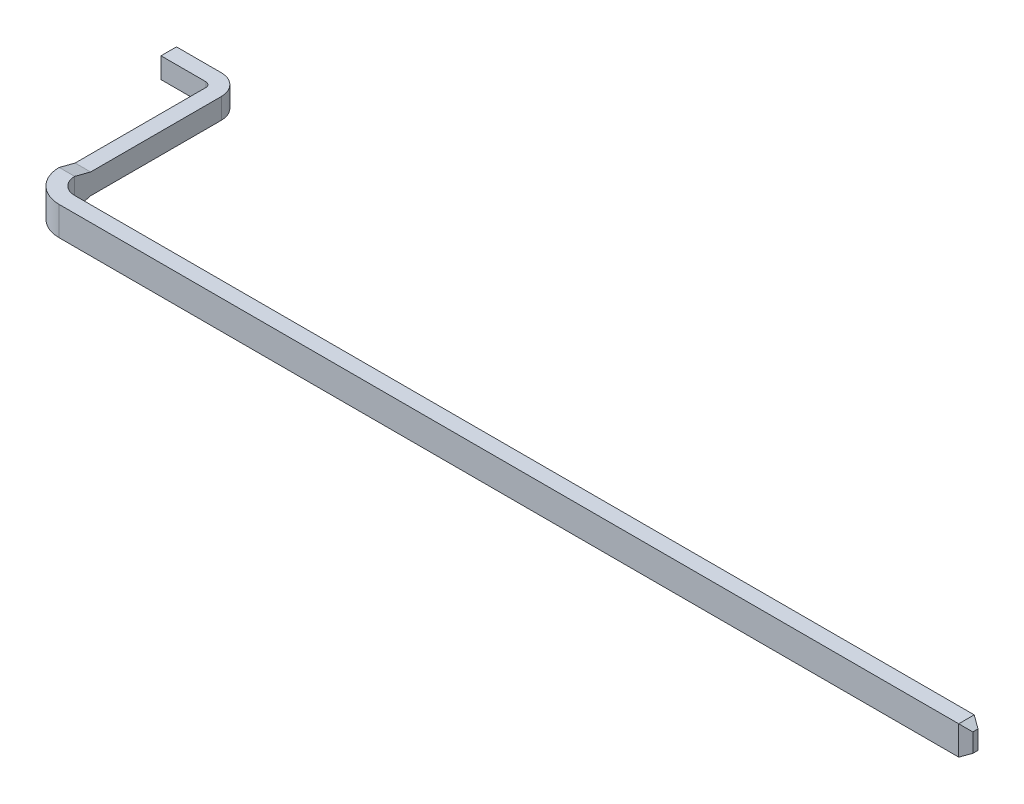
ISO-10303-21;
HEADER;
FILE_DESCRIPTION(('STEP AP214'),'2;1');
FILE_NAME('part.step','',(''),(''),'','','');
FILE_SCHEMA(('AUTOMOTIVE_DESIGN { 1 0 10303 214 1 1 1 1 }'));
ENDSEC;
DATA;
#1=APPLICATION_CONTEXT('core data for automotive mechanical design processes');
#2=APPLICATION_PROTOCOL_DEFINITION('international standard','automotive_design',2000,#1);
#3=PRODUCT_CONTEXT('',#1,'mechanical');
#4=PRODUCT('Part','Part','',(#3));
#5=PRODUCT_RELATED_PRODUCT_CATEGORY('part','',(#4));
#6=PRODUCT_DEFINITION_FORMATION('','',#4);
#7=PRODUCT_DEFINITION_CONTEXT('part definition',#1,'design');
#8=PRODUCT_DEFINITION('design','',#6,#7);
#9=PRODUCT_DEFINITION_SHAPE('','',#8);
#10=(LENGTH_UNIT() NAMED_UNIT(*) SI_UNIT(.MILLI.,.METRE.));
#11=(NAMED_UNIT(*) PLANE_ANGLE_UNIT() SI_UNIT($,.RADIAN.));
#12=(NAMED_UNIT(*) SI_UNIT($,.STERADIAN.) SOLID_ANGLE_UNIT());
#13=UNCERTAINTY_MEASURE_WITH_UNIT(LENGTH_MEASURE(1.E-05),#10,'distance_accuracy_value','');
#14=(GEOMETRIC_REPRESENTATION_CONTEXT(3) GLOBAL_UNCERTAINTY_ASSIGNED_CONTEXT((#13)) GLOBAL_UNIT_ASSIGNED_CONTEXT((#10,
#11,#12)) REPRESENTATION_CONTEXT('',''));
#15=CARTESIAN_POINT('',(0.,0.,0.));
#16=DIRECTION('',(0.,0.,1.));
#17=DIRECTION('',(1.,0.,0.));
#18=AXIS2_PLACEMENT_3D('',#15,#16,#17);
#19=CARTESIAN_POINT('',(-0.633705765484,0.14,0.39));
#20=DIRECTION('',(0.,0.,-1.));
#21=DIRECTION('',(-1.,0.,0.));
#22=AXIS2_PLACEMENT_3D('',#19,#20,#21);
#23=PLANE('',#22);
#24=DIRECTION('',(1.,0.,0.));
#25=VECTOR('',#24,1.);
#26=CARTESIAN_POINT('',(0.16,-0.1,0.39));
#27=LINE('',#26,#25);
#28=CARTESIAN_POINT('',(-0.2,-0.1,0.39));
#29=VERTEX_POINT('',#28);
#30=CARTESIAN_POINT('',(-0.633705765484,-0.1,0.39));
#31=VERTEX_POINT('',#30);
#32=EDGE_CURVE('E122',#29,#31,#27,.F.);
#33=ORIENTED_EDGE('',*,*,#32,.T.);
#34=DIRECTION('',(0.,1.,0.));
#35=VECTOR('',#34,1.);
#36=CARTESIAN_POINT('',(-0.633705765484,0.14,0.39));
#37=LINE('',#36,#35);
#38=CARTESIAN_POINT('',(-0.633705765484,0.1,0.39));
#39=VERTEX_POINT('',#38);
#40=EDGE_CURVE('E125',#31,#39,#37,.T.);
#41=ORIENTED_EDGE('',*,*,#40,.T.);
#42=DIRECTION('',(1.,0.,0.));
#43=VECTOR('',#42,1.);
#44=CARTESIAN_POINT('',(0.16,0.1,0.39));
#45=LINE('',#44,#43);
#46=CARTESIAN_POINT('',(-0.2,0.1,0.39));
#47=VERTEX_POINT('',#46);
#48=EDGE_CURVE('E162',#47,#39,#45,.F.);
#49=ORIENTED_EDGE('',*,*,#48,.F.);
#50=DIRECTION('',(0.,1.,0.));
#51=VECTOR('',#50,1.);
#52=CARTESIAN_POINT('',(-0.2,-0.1,0.39));
#53=LINE('',#52,#51);
#54=EDGE_CURVE('E127',#29,#47,#53,.T.);
#55=ORIENTED_EDGE('',*,*,#54,.F.);
#56=EDGE_LOOP('',(#33,#41,#49,#55));
#57=FACE_BOUND('',#56,.T.);
#58=ADVANCED_FACE('F17',(#57),#23,.T.);
#59=CARTESIAN_POINT('',(-0.633705765484,0.14,0.39));
#60=DIRECTION('',(1.,0.,0.));
#61=DIRECTION('',(0.,0.,-1.));
#62=AXIS2_PLACEMENT_3D('',#59,#60,#61);
#63=PLANE('',#62);
#64=DIRECTION('',(0.,0.,1.));
#65=VECTOR('',#64,1.);
#66=CARTESIAN_POINT('',(-0.633705765484,0.1,1.855));
#67=LINE('',#66,#65);
#68=CARTESIAN_POINT('',(-0.633705765484,0.1,0.54));
#69=VERTEX_POINT('',#68);
#70=EDGE_CURVE('E139',#39,#69,#67,.T.);
#71=ORIENTED_EDGE('',*,*,#70,.F.);
#72=ORIENTED_EDGE('',*,*,#40,.F.);
#73=DIRECTION('',(0.,0.,1.));
#74=VECTOR('',#73,1.);
#75=CARTESIAN_POINT('',(-0.633705765484,-0.1,1.855));
#76=LINE('',#75,#74);
#77=CARTESIAN_POINT('',(-0.633705765484,-0.1,0.54));
#78=VERTEX_POINT('',#77);
#79=EDGE_CURVE('E132',#31,#78,#76,.T.);
#80=ORIENTED_EDGE('',*,*,#79,.T.);
#81=DIRECTION('',(0.,1.,0.));
#82=VECTOR('',#81,1.);
#83=CARTESIAN_POINT('',(-0.633705765484,0.14,0.54));
#84=LINE('',#83,#82);
#85=EDGE_CURVE('E141',#78,#69,#84,.T.);
#86=ORIENTED_EDGE('',*,*,#85,.T.);
#87=EDGE_LOOP('',(#71,#72,#80,#86));
#88=FACE_BOUND('',#87,.T.);
#89=ADVANCED_FACE('F136',(#88),#63,.F.);
#90=CARTESIAN_POINT('',(-0.633705765484,0.14,0.54));
#91=DIRECTION('',(0.,0.,-1.));
#92=DIRECTION('',(-1.,0.,0.));
#93=AXIS2_PLACEMENT_3D('',#90,#91,#92);
#94=PLANE('',#93);
#95=DIRECTION('',(1.,0.,0.));
#96=VECTOR('',#95,1.);
#97=CARTESIAN_POINT('',(0.16,0.1,0.54));
#98=LINE('',#97,#96);
#99=CARTESIAN_POINT('',(-0.2,0.1,0.54));
#100=VERTEX_POINT('',#99);
#101=EDGE_CURVE('E161',#69,#100,#98,.T.);
#102=ORIENTED_EDGE('',*,*,#101,.F.);
#103=ORIENTED_EDGE('',*,*,#85,.F.);
#104=DIRECTION('',(1.,0.,0.));
#105=VECTOR('',#104,1.);
#106=CARTESIAN_POINT('',(0.16,-0.1,0.54));
#107=LINE('',#106,#105);
#108=CARTESIAN_POINT('',(-0.2,-0.1,0.54));
#109=VERTEX_POINT('',#108);
#110=EDGE_CURVE('E146',#78,#109,#107,.T.);
#111=ORIENTED_EDGE('',*,*,#110,.T.);
#112=DIRECTION('',(0.,1.,0.));
#113=VECTOR('',#112,1.);
#114=CARTESIAN_POINT('',(-0.2,-0.1,0.54));
#115=LINE('',#114,#113);
#116=EDGE_CURVE('E207',#109,#100,#115,.T.);
#117=ORIENTED_EDGE('',*,*,#116,.T.);
#118=EDGE_LOOP('',(#102,#103,#111,#117));
#119=FACE_BOUND('',#118,.T.);
#120=ADVANCED_FACE('F209',(#119),#94,.F.);
#121=CARTESIAN_POINT('',(-0.2,-0.1,0.59));
#122=DIRECTION('',(0.,1.,0.));
#123=DIRECTION('',(0.,0.,1.));
#124=AXIS2_PLACEMENT_3D('',#121,#122,#123);
#125=CYLINDRICAL_SURFACE('',#124,0.05);
#126=DIRECTION('',(0.,1.,0.));
#127=VECTOR('',#126,1.);
#128=CARTESIAN_POINT('',(-0.15,0.14,0.59));
#129=LINE('',#128,#127);
#130=CARTESIAN_POINT('',(-0.15,-0.1,0.59));
#131=VERTEX_POINT('',#130);
#132=CARTESIAN_POINT('',(-0.15,0.1,0.59));
#133=VERTEX_POINT('',#132);
#134=EDGE_CURVE('E159',#131,#133,#129,.T.);
#135=ORIENTED_EDGE('',*,*,#134,.T.);
#136=CARTESIAN_POINT('',(-0.2,0.1,0.59));
#137=DIRECTION('',(0.,1.,0.));
#138=DIRECTION('',(0.,0.,1.));
#139=AXIS2_PLACEMENT_3D('',#136,#137,#138);
#140=CIRCLE('',#139,0.05);
#141=EDGE_CURVE('E184',#100,#133,#140,.F.);
#142=ORIENTED_EDGE('',*,*,#141,.F.);
#143=ORIENTED_EDGE('',*,*,#116,.F.);
#144=CARTESIAN_POINT('',(-0.2,-0.1,0.59));
#145=DIRECTION('',(0.,1.,0.));
#146=DIRECTION('',(0.,0.,1.));
#147=AXIS2_PLACEMENT_3D('',#144,#145,#146);
#148=CIRCLE('',#147,0.05);
#149=EDGE_CURVE('E148',#109,#131,#148,.F.);
#150=ORIENTED_EDGE('',*,*,#149,.T.);
#151=EDGE_LOOP('',(#135,#142,#143,#150));
#152=FACE_BOUND('',#151,.T.);
#153=ADVANCED_FACE('F544',(#152),#125,.F.);
#154=CARTESIAN_POINT('',(-0.15,0.14,0.));
#155=DIRECTION('',(1.,0.,0.));
#156=DIRECTION('',(0.,0.,-1.));
#157=AXIS2_PLACEMENT_3D('',#154,#155,#156);
#158=PLANE('',#157);
#159=ORIENTED_EDGE('',*,*,#134,.F.);
#160=DIRECTION('',(0.,0.,1.));
#161=VECTOR('',#160,1.);
#162=CARTESIAN_POINT('',(-0.15,-0.1,1.855));
#163=LINE('',#162,#161);
#164=CARTESIAN_POINT('',(-0.15,-0.0999999999999678,1.85500000000001));
#165=VERTEX_POINT('',#164);
#166=EDGE_CURVE('E182',#131,#165,#163,.T.);
#167=ORIENTED_EDGE('',*,*,#166,.T.);
#168=DIRECTION('',(0.,-0.249878019022072,0.96827732370928));
#169=VECTOR('',#168,1.);
#170=CARTESIAN_POINT('',(-0.15,-0.14,2.01));
#171=LINE('',#170,#169);
#172=CARTESIAN_POINT('',(-0.15,-0.14,2.01));
#173=VERTEX_POINT('',#172);
#174=EDGE_CURVE('E240',#165,#173,#171,.T.);
#175=ORIENTED_EDGE('',*,*,#174,.T.);
#176=DIRECTION('',(0.,-1.,0.));
#177=VECTOR('',#176,1.);
#178=CARTESIAN_POINT('',(-0.15,0.14,2.01));
#179=LINE('',#178,#177);
#180=CARTESIAN_POINT('',(-0.15,0.14,2.01));
#181=VERTEX_POINT('',#180);
#182=EDGE_CURVE('E269',#181,#173,#179,.T.);
#183=ORIENTED_EDGE('',*,*,#182,.F.);
#184=DIRECTION('',(0.,0.249878019022072,0.96827732370928));
#185=VECTOR('',#184,1.);
#186=CARTESIAN_POINT('',(-0.15,0.14,2.01));
#187=LINE('',#186,#185);
#188=CARTESIAN_POINT('',(-0.15,0.0999999999999678,1.85500000000001));
#189=VERTEX_POINT('',#188);
#190=EDGE_CURVE('E203',#189,#181,#187,.T.);
#191=ORIENTED_EDGE('',*,*,#190,.F.);
#192=DIRECTION('',(0.,0.,1.));
#193=VECTOR('',#192,1.);
#194=CARTESIAN_POINT('',(-0.15,0.1,1.855));
#195=LINE('',#194,#193);
#196=EDGE_CURVE('E183',#133,#189,#195,.T.);
#197=ORIENTED_EDGE('',*,*,#196,.F.);
#198=EDGE_LOOP('',(#159,#167,#175,#183,#191,#197));
#199=FACE_BOUND('',#198,.T.);
#200=ADVANCED_FACE('F306',(#199),#158,.F.);
#201=CARTESIAN_POINT('',(8.96,0.14,2.27));
#202=DIRECTION('',(0.50000000000019,0.,0.866025403784329));
#203=DIRECTION('',(0.866025403784329,0.,-0.50000000000019));
#204=AXIS2_PLACEMENT_3D('',#201,#202,#203);
#205=PLANE('',#204);
#206=DIRECTION('',(-0.774596669240792,0.447213595499784,0.447213595501328));
#207=VECTOR('',#206,1.);
#208=CARTESIAN_POINT('',(8.9600000000001,0.0900000000001725,2.27));
#209=LINE('',#208,#207);
#210=CARTESIAN_POINT('',(8.96000000000007,0.090000000000115,2.27));
#211=VERTEX_POINT('',#210);
#212=CARTESIAN_POINT('',(8.873397459622,0.14,2.32));
#213=VERTEX_POINT('',#212);
#214=EDGE_CURVE('E241',#211,#213,#209,.T.);
#215=ORIENTED_EDGE('',*,*,#214,.T.);
#216=DIRECTION('',(0.,1.,0.));
#217=VECTOR('',#216,1.);
#218=CARTESIAN_POINT('',(8.873397459622,0.14,2.32));
#219=LINE('',#218,#217);
#220=CARTESIAN_POINT('',(8.87339745962197,-0.139999999999957,2.32));
#221=VERTEX_POINT('',#220);
#222=EDGE_CURVE('E260',#213,#221,#219,.F.);
#223=ORIENTED_EDGE('',*,*,#222,.T.);
#224=DIRECTION('',(-0.774596669240792,-0.447213595499785,0.447213595501328));
#225=VECTOR('',#224,1.);
#226=CARTESIAN_POINT('',(8.96,-0.09,2.27));
#227=LINE('',#226,#225);
#228=CARTESIAN_POINT('',(8.96,-0.09,2.27));
#229=VERTEX_POINT('',#228);
#230=EDGE_CURVE('E252',#229,#221,#227,.T.);
#231=ORIENTED_EDGE('',*,*,#230,.F.);
#232=DIRECTION('',(0.,1.,0.));
#233=VECTOR('',#232,1.);
#234=CARTESIAN_POINT('',(8.96,0.14,2.27));
#235=LINE('',#234,#233);
#236=EDGE_CURVE('E199',#211,#229,#235,.F.);
#237=ORIENTED_EDGE('',*,*,#236,.F.);
#238=EDGE_LOOP('',(#215,#223,#231,#237));
#239=FACE_BOUND('',#238,.T.);
#240=ADVANCED_FACE('F389',(#239),#205,.T.);
#241=CARTESIAN_POINT('',(-0.2,-0.1,0.59));
#242=DIRECTION('',(0.,1.,0.));
#243=DIRECTION('',(0.,0.,1.));
#244=AXIS2_PLACEMENT_3D('',#241,#242,#243);
#245=CYLINDRICAL_SURFACE('',#244,0.2);
#246=CARTESIAN_POINT('',(-0.2,0.1,0.59));
#247=DIRECTION('',(0.,1.,0.));
#248=DIRECTION('',(0.,0.,1.));
#249=AXIS2_PLACEMENT_3D('',#246,#247,#248);
#250=CIRCLE('',#249,0.2);
#251=CARTESIAN_POINT('',(0.,0.1,0.59));
#252=VERTEX_POINT('',#251);
#253=EDGE_CURVE('E20',#252,#47,#250,.T.);
#254=ORIENTED_EDGE('',*,*,#253,.F.);
#255=DIRECTION('',(0.,1.,0.));
#256=VECTOR('',#255,1.);
#257=CARTESIAN_POINT('',(0.,0.14,0.59));
#258=LINE('',#257,#256);
#259=CARTESIAN_POINT('',(0.,-0.1,0.59));
#260=VERTEX_POINT('',#259);
#261=EDGE_CURVE('E214',#260,#252,#258,.T.);
#262=ORIENTED_EDGE('',*,*,#261,.F.);
#263=CARTESIAN_POINT('',(-0.2,-0.1,0.59));
#264=DIRECTION('',(0.,1.,0.));
#265=DIRECTION('',(0.,0.,1.));
#266=AXIS2_PLACEMENT_3D('',#263,#264,#265);
#267=CIRCLE('',#266,0.2);
#268=EDGE_CURVE('E133',#260,#29,#267,.T.);
#269=ORIENTED_EDGE('',*,*,#268,.T.);
#270=ORIENTED_EDGE('',*,*,#54,.T.);
#271=EDGE_LOOP('',(#254,#262,#269,#270));
#272=FACE_BOUND('',#271,.T.);
#273=ADVANCED_FACE('F212',(#272),#245,.T.);
#274=CARTESIAN_POINT('',(0.16,0.1,1.855));
#275=DIRECTION('',(0.,1.,0.));
#276=DIRECTION('',(0.,0.,1.));
#277=AXIS2_PLACEMENT_3D('',#274,#275,#276);
#278=PLANE('',#277);
#279=ORIENTED_EDGE('',*,*,#196,.T.);
#280=DIRECTION('',(1.,0.,0.));
#281=VECTOR('',#280,1.);
#282=CARTESIAN_POINT('',(0.16,0.0999999999999517,1.85500000000001));
#283=LINE('',#282,#281);
#284=CARTESIAN_POINT('',(0.,0.0999999999999834,1.855));
#285=VERTEX_POINT('',#284);
#286=EDGE_CURVE('E101',#285,#189,#283,.F.);
#287=ORIENTED_EDGE('',*,*,#286,.F.);
#288=DIRECTION('',(0.,0.,-1.));
#289=VECTOR('',#288,1.);
#290=CARTESIAN_POINT('',(0.,0.1,0.));
#291=LINE('',#290,#289);
#292=EDGE_CURVE('E247',#252,#285,#291,.F.);
#293=ORIENTED_EDGE('',*,*,#292,.F.);
#294=ORIENTED_EDGE('',*,*,#253,.T.);
#295=ORIENTED_EDGE('',*,*,#48,.T.);
#296=ORIENTED_EDGE('',*,*,#70,.T.);
#297=ORIENTED_EDGE('',*,*,#101,.T.);
#298=ORIENTED_EDGE('',*,*,#141,.T.);
#299=EDGE_LOOP('',(#279,#287,#293,#294,#295,#296,#297,#298));
#300=FACE_BOUND('',#299,.T.);
#301=ADVANCED_FACE('F211',(#300),#278,.T.);
#302=CARTESIAN_POINT('',(0.16,-0.1,1.855));
#303=DIRECTION('',(0.,1.,0.));
#304=DIRECTION('',(0.,0.,1.));
#305=AXIS2_PLACEMENT_3D('',#302,#303,#304);
#306=PLANE('',#305);
#307=ORIENTED_EDGE('',*,*,#149,.F.);
#308=ORIENTED_EDGE('',*,*,#110,.F.);
#309=ORIENTED_EDGE('',*,*,#79,.F.);
#310=ORIENTED_EDGE('',*,*,#32,.F.);
#311=ORIENTED_EDGE('',*,*,#268,.F.);
#312=DIRECTION('',(0.,0.,-1.));
#313=VECTOR('',#312,1.);
#314=CARTESIAN_POINT('',(0.,-0.1,0.));
#315=LINE('',#314,#313);
#316=CARTESIAN_POINT('',(0.,-0.099999999999984,1.855));
#317=VERTEX_POINT('',#316);
#318=EDGE_CURVE('E218',#317,#260,#315,.T.);
#319=ORIENTED_EDGE('',*,*,#318,.F.);
#320=DIRECTION('',(1.,0.,0.));
#321=VECTOR('',#320,1.);
#322=CARTESIAN_POINT('',(0.16,-0.0999999999999517,1.85500000000001));
#323=LINE('',#322,#321);
#324=EDGE_CURVE('E238',#317,#165,#323,.F.);
#325=ORIENTED_EDGE('',*,*,#324,.T.);
#326=ORIENTED_EDGE('',*,*,#166,.F.);
#327=EDGE_LOOP('',(#307,#308,#309,#310,#311,#319,#325,#326));
#328=FACE_BOUND('',#327,.T.);
#329=ADVANCED_FACE('F145',(#328),#306,.F.);
#330=CARTESIAN_POINT('',(0.16,0.14,2.01));
#331=DIRECTION('',(0.,0.96827732370928,-0.249878019022072));
#332=DIRECTION('',(0.,0.249878019022072,0.96827732370928));
#333=AXIS2_PLACEMENT_3D('',#330,#331,#332);
#334=PLANE('',#333);
#335=DIRECTION('',(1.,0.,0.));
#336=VECTOR('',#335,1.);
#337=CARTESIAN_POINT('',(0.16,0.14,2.01));
#338=LINE('',#337,#336);
#339=CARTESIAN_POINT('',(0.,0.14,2.01));
#340=VERTEX_POINT('',#339);
#341=EDGE_CURVE('E180',#340,#181,#338,.F.);
#342=ORIENTED_EDGE('',*,*,#341,.F.);
#343=DIRECTION('',(0.,0.24987801902177,0.968277323709357));
#344=VECTOR('',#343,1.);
#345=CARTESIAN_POINT('',(0.,0.1,1.855));
#346=LINE('',#345,#344);
#347=EDGE_CURVE('E231',#285,#340,#346,.T.);
#348=ORIENTED_EDGE('',*,*,#347,.F.);
#349=ORIENTED_EDGE('',*,*,#286,.T.);
#350=ORIENTED_EDGE('',*,*,#190,.T.);
#351=EDGE_LOOP('',(#342,#348,#349,#350));
#352=FACE_BOUND('',#351,.T.);
#353=ADVANCED_FACE('F397',(#352),#334,.T.);
#354=CARTESIAN_POINT('',(8.96,0.14,2.17));
#355=DIRECTION('',(1.,0.,0.));
#356=DIRECTION('',(0.,0.,-1.));
#357=AXIS2_PLACEMENT_3D('',#354,#355,#356);
#358=PLANE('',#357);
#359=ORIENTED_EDGE('',*,*,#236,.T.);
#360=DIRECTION('',(0.,0.,1.));
#361=VECTOR('',#360,1.);
#362=CARTESIAN_POINT('',(8.96,-0.09,2.17));
#363=LINE('',#362,#361);
#364=CARTESIAN_POINT('',(8.96000000000007,-0.09,2.21999999999983));
#365=VERTEX_POINT('',#364);
#366=EDGE_CURVE('E254',#365,#229,#363,.T.);
#367=ORIENTED_EDGE('',*,*,#366,.F.);
#368=DIRECTION('',(0.,1.,0.));
#369=VECTOR('',#368,1.);
#370=CARTESIAN_POINT('',(8.9600000000001,0.14,2.21999999999983));
#371=LINE('',#370,#369);
#372=CARTESIAN_POINT('',(8.9600000000001,0.0900000000000575,2.21999999999983));
#373=VERTEX_POINT('',#372);
#374=EDGE_CURVE('E179',#365,#373,#371,.T.);
#375=ORIENTED_EDGE('',*,*,#374,.T.);
#376=DIRECTION('',(0.,0.,1.));
#377=VECTOR('',#376,1.);
#378=CARTESIAN_POINT('',(8.9600000000001,0.0900000000001725,2.17));
#379=LINE('',#378,#377);
#380=EDGE_CURVE('E202',#373,#211,#379,.T.);
#381=ORIENTED_EDGE('',*,*,#380,.T.);
#382=EDGE_LOOP('',(#359,#367,#375,#381));
#383=FACE_BOUND('',#382,.T.);
#384=ADVANCED_FACE('F386',(#383),#358,.T.);
#385=CARTESIAN_POINT('',(8.873397459622,0.14,2.17));
#386=DIRECTION('',(-0.50000000000019,-0.866025403784329,0.));
#387=DIRECTION('',(0.866025403784329,-0.50000000000019,0.));
#388=AXIS2_PLACEMENT_3D('',#385,#386,#387);
#389=PLANE('',#388);
#390=ORIENTED_EDGE('',*,*,#380,.F.);
#391=DIRECTION('',(-0.774596669240793,0.447213595501327,-0.447213595499785));
#392=VECTOR('',#391,1.);
#393=CARTESIAN_POINT('',(8.9600000000001,0.09,2.21999999999983));
#394=LINE('',#393,#392);
#395=CARTESIAN_POINT('',(8.873397459622,0.14,2.17));
#396=VERTEX_POINT('',#395);
#397=EDGE_CURVE('E283',#373,#396,#394,.T.);
#398=ORIENTED_EDGE('',*,*,#397,.T.);
#399=DIRECTION('',(0.,0.,1.));
#400=VECTOR('',#399,1.);
#401=CARTESIAN_POINT('',(8.873397459622,0.14,2.17));
#402=LINE('',#401,#400);
#403=EDGE_CURVE('E229',#213,#396,#402,.F.);
#404=ORIENTED_EDGE('',*,*,#403,.F.);
#405=ORIENTED_EDGE('',*,*,#214,.F.);
#406=EDGE_LOOP('',(#390,#398,#404,#405));
#407=FACE_BOUND('',#406,.T.);
#408=ADVANCED_FACE('F391',(#407),#389,.F.);
#409=CARTESIAN_POINT('',(0.16,-0.14,2.01));
#410=DIRECTION('',(0.,0.96827732370928,0.249878019022072));
#411=DIRECTION('',(0.,-0.249878019022072,0.96827732370928));
#412=AXIS2_PLACEMENT_3D('',#409,#410,#411);
#413=PLANE('',#412);
#414=DIRECTION('',(1.,0.,0.));
#415=VECTOR('',#414,1.);
#416=CARTESIAN_POINT('',(0.,-0.14,2.01));
#417=LINE('',#416,#415);
#418=CARTESIAN_POINT('',(0.,-0.14,2.01));
#419=VERTEX_POINT('',#418);
#420=EDGE_CURVE('E175',#419,#173,#417,.F.);
#421=ORIENTED_EDGE('',*,*,#420,.T.);
#422=ORIENTED_EDGE('',*,*,#174,.F.);
#423=ORIENTED_EDGE('',*,*,#324,.F.);
#424=DIRECTION('',(0.,0.24987801902177,-0.968277323709357));
#425=VECTOR('',#424,1.);
#426=CARTESIAN_POINT('',(0.,-0.14,2.01));
#427=LINE('',#426,#425);
#428=EDGE_CURVE('E225',#419,#317,#427,.T.);
#429=ORIENTED_EDGE('',*,*,#428,.F.);
#430=EDGE_LOOP('',(#421,#422,#423,#429));
#431=FACE_BOUND('',#430,.T.);
#432=ADVANCED_FACE('F311',(#431),#413,.F.);
#433=CARTESIAN_POINT('',(0.16,0.14,2.01));
#434=DIRECTION('',(0.,-1.,0.));
#435=DIRECTION('',(0.,0.,-1.));
#436=AXIS2_PLACEMENT_3D('',#433,#434,#435);
#437=CYLINDRICAL_SURFACE('',#436,0.31);
#438=CARTESIAN_POINT('',(0.16,0.14,2.01));
#439=DIRECTION('',(0.,-1.,0.));
#440=DIRECTION('',(0.,0.,-1.));
#441=AXIS2_PLACEMENT_3D('',#438,#439,#440);
#442=CIRCLE('',#441,0.31);
#443=CARTESIAN_POINT('',(0.16,0.14,2.32));
#444=VERTEX_POINT('',#443);
#445=EDGE_CURVE('E176',#181,#444,#442,.F.);
#446=ORIENTED_EDGE('',*,*,#445,.F.);
#447=ORIENTED_EDGE('',*,*,#182,.T.);
#448=CARTESIAN_POINT('',(0.16,-0.14,2.01));
#449=DIRECTION('',(0.,-1.,0.));
#450=DIRECTION('',(0.,0.,-1.));
#451=AXIS2_PLACEMENT_3D('',#448,#449,#450);
#452=CIRCLE('',#451,0.31);
#453=CARTESIAN_POINT('',(0.16,-0.14,2.32));
#454=VERTEX_POINT('',#453);
#455=EDGE_CURVE('E172',#173,#454,#452,.F.);
#456=ORIENTED_EDGE('',*,*,#455,.T.);
#457=DIRECTION('',(0.,1.,0.));
#458=VECTOR('',#457,1.);
#459=CARTESIAN_POINT('',(0.16,0.14,2.32));
#460=LINE('',#459,#458);
#461=EDGE_CURVE('E267',#454,#444,#460,.T.);
#462=ORIENTED_EDGE('',*,*,#461,.T.);
#463=EDGE_LOOP('',(#446,#447,#456,#462));
#464=FACE_BOUND('',#463,.T.);
#465=ADVANCED_FACE('F317',(#464),#437,.T.);
#466=CARTESIAN_POINT('',(0.16,0.14,2.32));
#467=DIRECTION('',(0.,0.,-1.));
#468=DIRECTION('',(-1.,0.,0.));
#469=AXIS2_PLACEMENT_3D('',#466,#467,#468);
#470=PLANE('',#469);
#471=ORIENTED_EDGE('',*,*,#222,.F.);
#472=DIRECTION('',(1.,0.,0.));
#473=VECTOR('',#472,1.);
#474=CARTESIAN_POINT('',(0.16,0.14,2.32));
#475=LINE('',#474,#473);
#476=EDGE_CURVE('E226',#444,#213,#475,.T.);
#477=ORIENTED_EDGE('',*,*,#476,.F.);
#478=ORIENTED_EDGE('',*,*,#461,.F.);
#479=DIRECTION('',(1.,0.,0.));
#480=VECTOR('',#479,1.);
#481=CARTESIAN_POINT('',(0.,-0.14,2.32));
#482=LINE('',#481,#480);
#483=EDGE_CURVE('E174',#454,#221,#482,.T.);
#484=ORIENTED_EDGE('',*,*,#483,.T.);
#485=EDGE_LOOP('',(#471,#477,#478,#484));
#486=FACE_BOUND('',#485,.T.);
#487=ADVANCED_FACE('F393',(#486),#470,.F.);
#488=CARTESIAN_POINT('',(8.96,-0.09,2.17));
#489=DIRECTION('',(0.50000000000019,-0.866025403784329,0.));
#490=DIRECTION('',(0.866025403784329,0.50000000000019,0.));
#491=AXIS2_PLACEMENT_3D('',#488,#489,#490);
#492=PLANE('',#491);
#493=ORIENTED_EDGE('',*,*,#230,.T.);
#494=DIRECTION('',(0.,0.,1.));
#495=VECTOR('',#494,1.);
#496=CARTESIAN_POINT('',(8.873397459622,-0.14,0.));
#497=LINE('',#496,#495);
#498=CARTESIAN_POINT('',(8.873397459622,-0.14,2.17));
#499=VERTEX_POINT('',#498);
#500=EDGE_CURVE('E171',#221,#499,#497,.F.);
#501=ORIENTED_EDGE('',*,*,#500,.T.);
#502=DIRECTION('',(0.774596669240793,0.447213595501327,0.447213595499785));
#503=VECTOR('',#502,1.);
#504=CARTESIAN_POINT('',(8.873397459622,-0.14,2.17));
#505=LINE('',#504,#503);
#506=EDGE_CURVE('E313',#499,#365,#505,.T.);
#507=ORIENTED_EDGE('',*,*,#506,.T.);
#508=ORIENTED_EDGE('',*,*,#366,.T.);
#509=EDGE_LOOP('',(#493,#501,#507,#508));
#510=FACE_BOUND('',#509,.T.);
#511=ADVANCED_FACE('F390',(#510),#492,.T.);
#512=CARTESIAN_POINT('',(0.,0.14,0.));
#513=DIRECTION('',(1.,0.,0.));
#514=DIRECTION('',(0.,0.,-1.));
#515=AXIS2_PLACEMENT_3D('',#512,#513,#514);
#516=PLANE('',#515);
#517=ORIENTED_EDGE('',*,*,#428,.T.);
#518=ORIENTED_EDGE('',*,*,#318,.T.);
#519=ORIENTED_EDGE('',*,*,#261,.T.);
#520=ORIENTED_EDGE('',*,*,#292,.T.);
#521=ORIENTED_EDGE('',*,*,#347,.T.);
#522=DIRECTION('',(0.,-1.,0.));
#523=VECTOR('',#522,1.);
#524=CARTESIAN_POINT('',(0.,0.14,2.01));
#525=LINE('',#524,#523);
#526=EDGE_CURVE('E167',#340,#419,#525,.T.);
#527=ORIENTED_EDGE('',*,*,#526,.T.);
#528=EDGE_LOOP('',(#517,#518,#519,#520,#521,#527));
#529=FACE_BOUND('',#528,.T.);
#530=ADVANCED_FACE('F221',(#529),#516,.T.);
#531=CARTESIAN_POINT('',(0.16,0.14,2.17));
#532=DIRECTION('',(0.,1.,0.));
#533=DIRECTION('',(0.,0.,1.));
#534=AXIS2_PLACEMENT_3D('',#531,#532,#533);
#535=PLANE('',#534);
#536=ORIENTED_EDGE('',*,*,#341,.T.);
#537=ORIENTED_EDGE('',*,*,#445,.T.);
#538=ORIENTED_EDGE('',*,*,#476,.T.);
#539=ORIENTED_EDGE('',*,*,#403,.T.);
#540=DIRECTION('',(-1.,0.,0.));
#541=VECTOR('',#540,1.);
#542=CARTESIAN_POINT('',(0.16,0.14,2.17));
#543=LINE('',#542,#541);
#544=CARTESIAN_POINT('',(0.16,0.14,2.17));
#545=VERTEX_POINT('',#544);
#546=EDGE_CURVE('E166',#545,#396,#543,.F.);
#547=ORIENTED_EDGE('',*,*,#546,.F.);
#548=CARTESIAN_POINT('',(0.16,0.14,2.01));
#549=DIRECTION('',(0.,-1.,0.));
#550=DIRECTION('',(0.,0.,-1.));
#551=AXIS2_PLACEMENT_3D('',#548,#549,#550);
#552=CIRCLE('',#551,0.16);
#553=EDGE_CURVE('E168',#545,#340,#552,.T.);
#554=ORIENTED_EDGE('',*,*,#553,.T.);
#555=EDGE_LOOP('',(#536,#537,#538,#539,#547,#554));
#556=FACE_BOUND('',#555,.T.);
#557=ADVANCED_FACE('F395',(#556),#535,.T.);
#558=CARTESIAN_POINT('',(8.873397459622,0.14,2.17));
#559=DIRECTION('',(-0.50000000000019,0.,0.866025403784329));
#560=DIRECTION('',(0.866025403784329,0.,0.50000000000019));
#561=AXIS2_PLACEMENT_3D('',#558,#559,#560);
#562=PLANE('',#561);
#563=DIRECTION('',(0.,1.,0.));
#564=VECTOR('',#563,1.);
#565=CARTESIAN_POINT('',(8.873397459622,0.14,2.17));
#566=LINE('',#565,#564);
#567=EDGE_CURVE('E333',#396,#499,#566,.F.);
#568=ORIENTED_EDGE('',*,*,#567,.F.);
#569=ORIENTED_EDGE('',*,*,#397,.F.);
#570=ORIENTED_EDGE('',*,*,#374,.F.);
#571=ORIENTED_EDGE('',*,*,#506,.F.);
#572=EDGE_LOOP('',(#568,#569,#570,#571));
#573=FACE_BOUND('',#572,.T.);
#574=ADVANCED_FACE('F373',(#573),#562,.F.);
#575=CARTESIAN_POINT('',(0.,-0.14,0.));
#576=DIRECTION('',(0.,1.,0.));
#577=DIRECTION('',(0.,0.,1.));
#578=AXIS2_PLACEMENT_3D('',#575,#576,#577);
#579=PLANE('',#578);
#580=ORIENTED_EDGE('',*,*,#500,.F.);
#581=ORIENTED_EDGE('',*,*,#483,.F.);
#582=ORIENTED_EDGE('',*,*,#455,.F.);
#583=ORIENTED_EDGE('',*,*,#420,.F.);
#584=CARTESIAN_POINT('',(0.16,-0.14,2.01));
#585=DIRECTION('',(0.,-1.,0.));
#586=DIRECTION('',(0.,0.,-1.));
#587=AXIS2_PLACEMENT_3D('',#584,#585,#586);
#588=CIRCLE('',#587,0.16);
#589=CARTESIAN_POINT('',(0.16,-0.14,2.17));
#590=VERTEX_POINT('',#589);
#591=EDGE_CURVE('E35',#419,#590,#588,.F.);
#592=ORIENTED_EDGE('',*,*,#591,.T.);
#593=DIRECTION('',(-1.,0.,0.));
#594=VECTOR('',#593,1.);
#595=CARTESIAN_POINT('',(0.16,-0.14,2.17));
#596=LINE('',#595,#594);
#597=EDGE_CURVE('E26',#499,#590,#596,.T.);
#598=ORIENTED_EDGE('',*,*,#597,.F.);
#599=EDGE_LOOP('',(#580,#581,#582,#583,#592,#598));
#600=FACE_BOUND('',#599,.T.);
#601=ADVANCED_FACE('F322',(#600),#579,.F.);
#602=CARTESIAN_POINT('',(0.16,0.14,2.01));
#603=DIRECTION('',(0.,-1.,0.));
#604=DIRECTION('',(0.,0.,-1.));
#605=AXIS2_PLACEMENT_3D('',#602,#603,#604);
#606=CYLINDRICAL_SURFACE('',#605,0.16);
#607=ORIENTED_EDGE('',*,*,#526,.F.);
#608=ORIENTED_EDGE('',*,*,#553,.F.);
#609=DIRECTION('',(0.,1.,0.));
#610=VECTOR('',#609,1.);
#611=CARTESIAN_POINT('',(0.16,0.14,2.17));
#612=LINE('',#611,#610);
#613=EDGE_CURVE('E11',#590,#545,#612,.T.);
#614=ORIENTED_EDGE('',*,*,#613,.F.);
#615=ORIENTED_EDGE('',*,*,#591,.F.);
#616=EDGE_LOOP('',(#607,#608,#614,#615));
#617=FACE_BOUND('',#616,.T.);
#618=ADVANCED_FACE('F366',(#617),#606,.F.);
#619=CARTESIAN_POINT('',(0.16,0.14,2.17));
#620=DIRECTION('',(0.,0.,-1.));
#621=DIRECTION('',(-1.,0.,0.));
#622=AXIS2_PLACEMENT_3D('',#619,#620,#621);
#623=PLANE('',#622);
#624=ORIENTED_EDGE('',*,*,#597,.T.);
#625=ORIENTED_EDGE('',*,*,#613,.T.);
#626=ORIENTED_EDGE('',*,*,#546,.T.);
#627=ORIENTED_EDGE('',*,*,#567,.T.);
#628=EDGE_LOOP('',(#624,#625,#626,#627));
#629=FACE_BOUND('',#628,.T.);
#630=ADVANCED_FACE('F368',(#629),#623,.T.);
#631=CLOSED_SHELL('',(#58,#89,#120,#153,#200,#240,#273,#301,#329,#353,#384,#408,#432,#465,#487,
#511,#530,#557,#574,#601,#618,#630));
#632=MANIFOLD_SOLID_BREP('B1',#631);
#633=ADVANCED_BREP_SHAPE_REPRESENTATION('',(#18,#632),#14);
#634=SHAPE_DEFINITION_REPRESENTATION(#9,#633);
ENDSEC;
END-ISO-10303-21;
